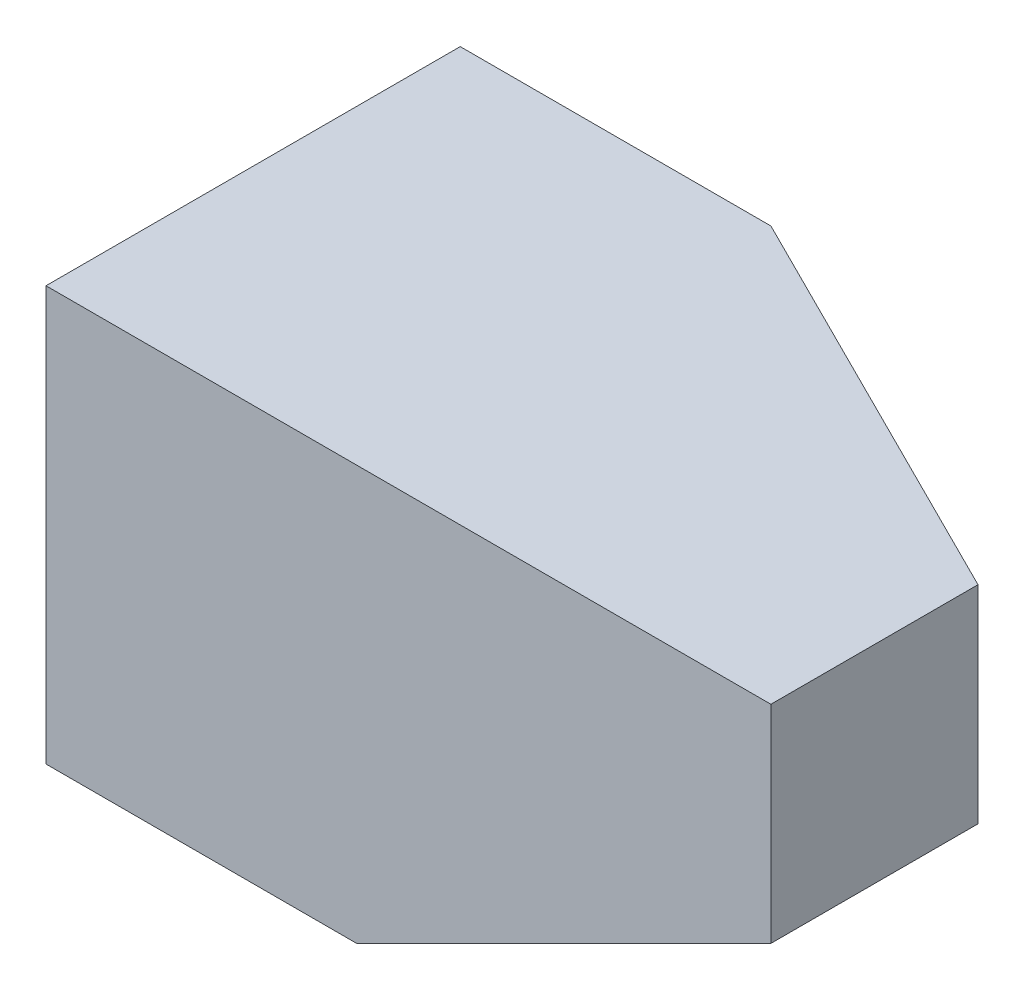
ISO-10303-21;
HEADER;
FILE_DESCRIPTION(('STEP AP214'),'2;1');
FILE_NAME('part.step','',(''),(''),'','','');
FILE_SCHEMA(('AUTOMOTIVE_DESIGN { 1 0 10303 214 1 1 1 1 }'));
ENDSEC;
DATA;
#1=APPLICATION_CONTEXT('core data for automotive mechanical design processes');
#2=APPLICATION_PROTOCOL_DEFINITION('international standard','automotive_design',2000,#1);
#3=PRODUCT_CONTEXT('',#1,'mechanical');
#4=PRODUCT('Part','Part','',(#3));
#5=PRODUCT_RELATED_PRODUCT_CATEGORY('part','',(#4));
#6=PRODUCT_DEFINITION_FORMATION('','',#4);
#7=PRODUCT_DEFINITION_CONTEXT('part definition',#1,'design');
#8=PRODUCT_DEFINITION('design','',#6,#7);
#9=PRODUCT_DEFINITION_SHAPE('','',#8);
#10=(LENGTH_UNIT() NAMED_UNIT(*) SI_UNIT(.MILLI.,.METRE.));
#11=(NAMED_UNIT(*) PLANE_ANGLE_UNIT() SI_UNIT($,.RADIAN.));
#12=(NAMED_UNIT(*) SI_UNIT($,.STERADIAN.) SOLID_ANGLE_UNIT());
#13=UNCERTAINTY_MEASURE_WITH_UNIT(LENGTH_MEASURE(1.E-05),#10,'distance_accuracy_value','');
#14=(GEOMETRIC_REPRESENTATION_CONTEXT(3) GLOBAL_UNCERTAINTY_ASSIGNED_CONTEXT((#13)) GLOBAL_UNIT_ASSIGNED_CONTEXT((#10,
#11,#12)) REPRESENTATION_CONTEXT('',''));
#15=CARTESIAN_POINT('',(0.,0.,0.));
#16=DIRECTION('',(0.,0.,1.));
#17=DIRECTION('',(1.,0.,0.));
#18=AXIS2_PLACEMENT_3D('',#15,#16,#17);
#19=CARTESIAN_POINT('',(-30.,40.,20.));
#20=DIRECTION('',(-1.,0.,0.));
#21=DIRECTION('',(0.,0.,1.));
#22=AXIS2_PLACEMENT_3D('',#19,#20,#21);
#23=PLANE('',#22);
#24=DIRECTION('',(0.,-0.707106781186548,0.707106781186548));
#25=VECTOR('',#24,1.);
#26=CARTESIAN_POINT('',(-30.,0.,0.));
#27=LINE('',#26,#25);
#28=CARTESIAN_POINT('',(-30.,20.,-20.));
#29=VERTEX_POINT('',#28);
#30=CARTESIAN_POINT('',(-30.,0.,0.));
#31=VERTEX_POINT('',#30);
#32=EDGE_CURVE('E86',#29,#31,#27,.T.);
#33=ORIENTED_EDGE('',*,*,#32,.T.);
#34=DIRECTION('',(0.,0.,-1.));
#35=VECTOR('',#34,1.);
#36=CARTESIAN_POINT('',(-30.,0.,20.));
#37=LINE('',#36,#35);
#38=CARTESIAN_POINT('',(-30.,0.,20.));
#39=VERTEX_POINT('',#38);
#40=EDGE_CURVE('E118',#39,#31,#37,.T.);
#41=ORIENTED_EDGE('',*,*,#40,.F.);
#42=DIRECTION('',(0.,-1.,0.));
#43=VECTOR('',#42,1.);
#44=CARTESIAN_POINT('',(-30.,40.,20.));
#45=LINE('',#44,#43);
#46=CARTESIAN_POINT('',(-30.,40.,20.));
#47=VERTEX_POINT('',#46);
#48=EDGE_CURVE('E41',#47,#39,#45,.T.);
#49=ORIENTED_EDGE('',*,*,#48,.F.);
#50=DIRECTION('',(0.,0.,-1.));
#51=VECTOR('',#50,1.);
#52=CARTESIAN_POINT('',(-30.,40.,20.));
#53=LINE('',#52,#51);
#54=CARTESIAN_POINT('',(-30.,40.,-20.));
#55=VERTEX_POINT('',#54);
#56=EDGE_CURVE('E106',#47,#55,#53,.T.);
#57=ORIENTED_EDGE('',*,*,#56,.T.);
#58=DIRECTION('',(0.,-1.,0.));
#59=VECTOR('',#58,1.);
#60=CARTESIAN_POINT('',(-30.,40.,-20.));
#61=LINE('',#60,#59);
#62=EDGE_CURVE('E101',#55,#29,#61,.T.);
#63=ORIENTED_EDGE('',*,*,#62,.T.);
#64=EDGE_LOOP('',(#33,#41,#49,#57,#63));
#65=FACE_BOUND('',#64,.T.);
#66=ADVANCED_FACE('F33',(#65),#23,.T.);
#67=CARTESIAN_POINT('',(-30.,40.,20.));
#68=DIRECTION('',(0.,0.,-1.));
#69=DIRECTION('',(-1.,0.,0.));
#70=AXIS2_PLACEMENT_3D('',#67,#68,#69);
#71=PLANE('',#70);
#72=DIRECTION('',(1.,0.,0.));
#73=VECTOR('',#72,1.);
#74=CARTESIAN_POINT('',(-30.,0.,20.));
#75=LINE('',#74,#73);
#76=CARTESIAN_POINT('',(0.,0.,20.));
#77=VERTEX_POINT('',#76);
#78=EDGE_CURVE('E115',#39,#77,#75,.T.);
#79=ORIENTED_EDGE('',*,*,#78,.T.);
#80=DIRECTION('',(0.894427190999916,0.447213595499958,0.));
#81=VECTOR('',#80,1.);
#82=CARTESIAN_POINT('',(0.,0.,20.));
#83=LINE('',#82,#81);
#84=CARTESIAN_POINT('',(40.,20.,20.));
#85=VERTEX_POINT('',#84);
#86=EDGE_CURVE('E144',#77,#85,#83,.T.);
#87=ORIENTED_EDGE('',*,*,#86,.T.);
#88=DIRECTION('',(0.,-1.,0.));
#89=VECTOR('',#88,1.);
#90=CARTESIAN_POINT('',(40.,40.,20.));
#91=LINE('',#90,#89);
#92=CARTESIAN_POINT('',(40.,40.,20.));
#93=VERTEX_POINT('',#92);
#94=EDGE_CURVE('E107',#93,#85,#91,.T.);
#95=ORIENTED_EDGE('',*,*,#94,.F.);
#96=DIRECTION('',(1.,0.,0.));
#97=VECTOR('',#96,1.);
#98=CARTESIAN_POINT('',(-30.,40.,20.));
#99=LINE('',#98,#97);
#100=EDGE_CURVE('E108',#47,#93,#99,.T.);
#101=ORIENTED_EDGE('',*,*,#100,.F.);
#102=ORIENTED_EDGE('',*,*,#48,.T.);
#103=EDGE_LOOP('',(#79,#87,#95,#101,#102));
#104=FACE_BOUND('',#103,.T.);
#105=ADVANCED_FACE('F179',(#104),#71,.F.);
#106=CARTESIAN_POINT('',(40.,40.,20.));
#107=DIRECTION('',(-1.,0.,0.));
#108=DIRECTION('',(0.,0.,1.));
#109=AXIS2_PLACEMENT_3D('',#106,#107,#108);
#110=PLANE('',#109);
#111=ORIENTED_EDGE('',*,*,#94,.T.);
#112=DIRECTION('',(0.,0.,-1.));
#113=VECTOR('',#112,1.);
#114=CARTESIAN_POINT('',(40.,20.,20.));
#115=LINE('',#114,#113);
#116=CARTESIAN_POINT('',(40.,20.,0.));
#117=VERTEX_POINT('',#116);
#118=EDGE_CURVE('E140',#85,#117,#115,.T.);
#119=ORIENTED_EDGE('',*,*,#118,.T.);
#120=DIRECTION('',(0.,-1.,0.));
#121=VECTOR('',#120,1.);
#122=CARTESIAN_POINT('',(40.,40.,0.));
#123=LINE('',#122,#121);
#124=CARTESIAN_POINT('',(40.,40.,0.));
#125=VERTEX_POINT('',#124);
#126=EDGE_CURVE('E125',#125,#117,#123,.T.);
#127=ORIENTED_EDGE('',*,*,#126,.F.);
#128=DIRECTION('',(0.,0.,-1.));
#129=VECTOR('',#128,1.);
#130=CARTESIAN_POINT('',(40.,40.,20.));
#131=LINE('',#130,#129);
#132=EDGE_CURVE('E111',#93,#125,#131,.T.);
#133=ORIENTED_EDGE('',*,*,#132,.F.);
#134=EDGE_LOOP('',(#111,#119,#127,#133));
#135=FACE_BOUND('',#134,.T.);
#136=ADVANCED_FACE('F174',(#135),#110,.F.);
#137=CARTESIAN_POINT('',(-30.,40.,-20.));
#138=DIRECTION('',(0.,0.,-1.));
#139=DIRECTION('',(-1.,0.,0.));
#140=AXIS2_PLACEMENT_3D('',#137,#138,#139);
#141=PLANE('',#140);
#142=DIRECTION('',(1.,0.,0.));
#143=VECTOR('',#142,1.);
#144=CARTESIAN_POINT('',(-30.,20.,-20.));
#145=LINE('',#144,#143);
#146=CARTESIAN_POINT('',(0.,20.,-20.));
#147=VERTEX_POINT('',#146);
#148=EDGE_CURVE('E89',#29,#147,#145,.T.);
#149=ORIENTED_EDGE('',*,*,#148,.F.);
#150=ORIENTED_EDGE('',*,*,#62,.F.);
#151=DIRECTION('',(1.,0.,0.));
#152=VECTOR('',#151,1.);
#153=CARTESIAN_POINT('',(-30.,40.,-20.));
#154=LINE('',#153,#152);
#155=CARTESIAN_POINT('',(0.,40.,-20.));
#156=VERTEX_POINT('',#155);
#157=EDGE_CURVE('E122',#55,#156,#154,.T.);
#158=ORIENTED_EDGE('',*,*,#157,.T.);
#159=DIRECTION('',(0.,-1.,0.));
#160=VECTOR('',#159,1.);
#161=CARTESIAN_POINT('',(0.,40.,-20.));
#162=LINE('',#161,#160);
#163=EDGE_CURVE('E103',#156,#147,#162,.T.);
#164=ORIENTED_EDGE('',*,*,#163,.T.);
#165=EDGE_LOOP('',(#149,#150,#158,#164));
#166=FACE_BOUND('',#165,.T.);
#167=ADVANCED_FACE('F99',(#166),#141,.T.);
#168=CARTESIAN_POINT('',(0.,40.,0.));
#169=DIRECTION('',(0.,-1.,0.));
#170=DIRECTION('',(0.,0.,-1.));
#171=AXIS2_PLACEMENT_3D('',#168,#169,#170);
#172=PLANE('',#171);
#173=ORIENTED_EDGE('',*,*,#132,.T.);
#174=DIRECTION('',(-0.894427190999916,0.,-0.447213595499958));
#175=VECTOR('',#174,1.);
#176=CARTESIAN_POINT('',(40.,40.,0.));
#177=LINE('',#176,#175);
#178=EDGE_CURVE('E128',#125,#156,#177,.T.);
#179=ORIENTED_EDGE('',*,*,#178,.T.);
#180=ORIENTED_EDGE('',*,*,#157,.F.);
#181=ORIENTED_EDGE('',*,*,#56,.F.);
#182=ORIENTED_EDGE('',*,*,#100,.T.);
#183=EDGE_LOOP('',(#173,#179,#180,#181,#182));
#184=FACE_BOUND('',#183,.T.);
#185=ADVANCED_FACE('F176',(#184),#172,.F.);
#186=CARTESIAN_POINT('',(0.,0.,0.));
#187=DIRECTION('',(0.,-1.,0.));
#188=DIRECTION('',(0.,0.,-1.));
#189=AXIS2_PLACEMENT_3D('',#186,#187,#188);
#190=PLANE('',#189);
#191=DIRECTION('',(1.,0.,0.));
#192=VECTOR('',#191,1.);
#193=CARTESIAN_POINT('',(-30.,0.,0.));
#194=LINE('',#193,#192);
#195=CARTESIAN_POINT('',(0.,0.,0.));
#196=VERTEX_POINT('',#195);
#197=EDGE_CURVE('E92',#31,#196,#194,.T.);
#198=ORIENTED_EDGE('',*,*,#197,.T.);
#199=DIRECTION('',(0.,0.,-1.));
#200=VECTOR('',#199,1.);
#201=CARTESIAN_POINT('',(0.,0.,20.));
#202=LINE('',#201,#200);
#203=EDGE_CURVE('E141',#77,#196,#202,.T.);
#204=ORIENTED_EDGE('',*,*,#203,.F.);
#205=ORIENTED_EDGE('',*,*,#78,.F.);
#206=ORIENTED_EDGE('',*,*,#40,.T.);
#207=EDGE_LOOP('',(#198,#204,#205,#206));
#208=FACE_BOUND('',#207,.T.);
#209=ADVANCED_FACE('F156',(#208),#190,.T.);
#210=CARTESIAN_POINT('',(40.,40.,0.));
#211=DIRECTION('',(-0.447213595499958,0.,0.894427190999916));
#212=DIRECTION('',(0.894427190999916,0.,0.447213595499958));
#213=AXIS2_PLACEMENT_3D('',#210,#211,#212);
#214=PLANE('',#213);
#215=ORIENTED_EDGE('',*,*,#126,.T.);
#216=DIRECTION('',(-0.894427190999916,0.,-0.447213595499958));
#217=VECTOR('',#216,1.);
#218=CARTESIAN_POINT('',(40.,20.,0.));
#219=LINE('',#218,#217);
#220=EDGE_CURVE('E11',#117,#147,#219,.T.);
#221=ORIENTED_EDGE('',*,*,#220,.T.);
#222=ORIENTED_EDGE('',*,*,#163,.F.);
#223=ORIENTED_EDGE('',*,*,#178,.F.);
#224=EDGE_LOOP('',(#215,#221,#222,#223));
#225=FACE_BOUND('',#224,.T.);
#226=ADVANCED_FACE('F170',(#225),#214,.F.);
#227=CARTESIAN_POINT('',(40.,20.,-20.));
#228=DIRECTION('',(0.,1.,0.));
#229=DIRECTION('',(0.,0.,1.));
#230=AXIS2_PLACEMENT_3D('',#227,#228,#229);
#231=PLANE('',#230);
#232=DIRECTION('',(-1.,0.,0.));
#233=VECTOR('',#232,1.);
#234=CARTESIAN_POINT('',(40.,20.,0.));
#235=LINE('',#234,#233);
#236=CARTESIAN_POINT('',(0.,20.,0.));
#237=VERTEX_POINT('',#236);
#238=EDGE_CURVE('E137',#117,#237,#235,.T.);
#239=ORIENTED_EDGE('',*,*,#238,.T.);
#240=DIRECTION('',(0.,0.,1.));
#241=VECTOR('',#240,1.);
#242=CARTESIAN_POINT('',(0.,20.,-20.));
#243=LINE('',#242,#241);
#244=EDGE_CURVE('E132',#147,#237,#243,.T.);
#245=ORIENTED_EDGE('',*,*,#244,.F.);
#246=ORIENTED_EDGE('',*,*,#220,.F.);
#247=EDGE_LOOP('',(#239,#245,#246));
#248=FACE_BOUND('',#247,.T.);
#249=ADVANCED_FACE('F168',(#248),#231,.F.);
#250=CARTESIAN_POINT('',(0.,0.,-20.));
#251=DIRECTION('',(-1.,0.,0.));
#252=DIRECTION('',(0.,0.,1.));
#253=AXIS2_PLACEMENT_3D('',#250,#251,#252);
#254=PLANE('',#253);
#255=DIRECTION('',(0.,-1.,0.));
#256=VECTOR('',#255,1.);
#257=CARTESIAN_POINT('',(0.,0.,0.));
#258=LINE('',#257,#256);
#259=EDGE_CURVE('E134',#237,#196,#258,.T.);
#260=ORIENTED_EDGE('',*,*,#259,.T.);
#261=DIRECTION('',(0.,-0.707106781186548,0.707106781186548));
#262=VECTOR('',#261,1.);
#263=CARTESIAN_POINT('',(0.,0.,0.));
#264=LINE('',#263,#262);
#265=EDGE_CURVE('E95',#147,#196,#264,.T.);
#266=ORIENTED_EDGE('',*,*,#265,.F.);
#267=ORIENTED_EDGE('',*,*,#244,.T.);
#268=EDGE_LOOP('',(#260,#266,#267));
#269=FACE_BOUND('',#268,.T.);
#270=ADVANCED_FACE('F166',(#269),#254,.F.);
#271=CARTESIAN_POINT('',(0.,0.,0.));
#272=DIRECTION('',(0.,0.,1.));
#273=DIRECTION('',(1.,0.,0.));
#274=AXIS2_PLACEMENT_3D('',#271,#272,#273);
#275=PLANE('',#274);
#276=ORIENTED_EDGE('',*,*,#238,.F.);
#277=DIRECTION('',(0.894427190999916,0.447213595499958,0.));
#278=VECTOR('',#277,1.);
#279=CARTESIAN_POINT('',(0.,0.,0.));
#280=LINE('',#279,#278);
#281=EDGE_CURVE('E147',#196,#117,#280,.T.);
#282=ORIENTED_EDGE('',*,*,#281,.F.);
#283=ORIENTED_EDGE('',*,*,#259,.F.);
#284=EDGE_LOOP('',(#276,#282,#283));
#285=FACE_BOUND('',#284,.T.);
#286=ADVANCED_FACE('F164',(#285),#275,.F.);
#287=CARTESIAN_POINT('',(0.,0.,20.));
#288=DIRECTION('',(-0.447213595499958,0.894427190999916,0.));
#289=DIRECTION('',(-0.894427190999916,-0.447213595499958,0.));
#290=AXIS2_PLACEMENT_3D('',#287,#288,#289);
#291=PLANE('',#290);
#292=ORIENTED_EDGE('',*,*,#281,.T.);
#293=ORIENTED_EDGE('',*,*,#118,.F.);
#294=ORIENTED_EDGE('',*,*,#86,.F.);
#295=ORIENTED_EDGE('',*,*,#203,.T.);
#296=EDGE_LOOP('',(#292,#293,#294,#295));
#297=FACE_BOUND('',#296,.T.);
#298=ADVANCED_FACE('F160',(#297),#291,.F.);
#299=CARTESIAN_POINT('',(-30.,0.,0.));
#300=DIRECTION('',(0.,0.707106781186547,0.707106781186547));
#301=DIRECTION('',(0.,-0.707106781186548,0.707106781186548));
#302=AXIS2_PLACEMENT_3D('',#299,#300,#301);
#303=PLANE('',#302);
#304=ORIENTED_EDGE('',*,*,#265,.T.);
#305=ORIENTED_EDGE('',*,*,#197,.F.);
#306=ORIENTED_EDGE('',*,*,#32,.F.);
#307=ORIENTED_EDGE('',*,*,#148,.T.);
#308=EDGE_LOOP('',(#304,#305,#306,#307));
#309=FACE_BOUND('',#308,.T.);
#310=ADVANCED_FACE('F88',(#309),#303,.F.);
#311=CLOSED_SHELL('',(#66,#105,#136,#167,#185,#209,#226,#249,#270,#286,#298,#310));
#312=MANIFOLD_SOLID_BREP('B2',#311);
#313=ADVANCED_BREP_SHAPE_REPRESENTATION('',(#18,#312),#14);
#314=SHAPE_DEFINITION_REPRESENTATION(#9,#313);
ENDSEC;
END-ISO-10303-21;
